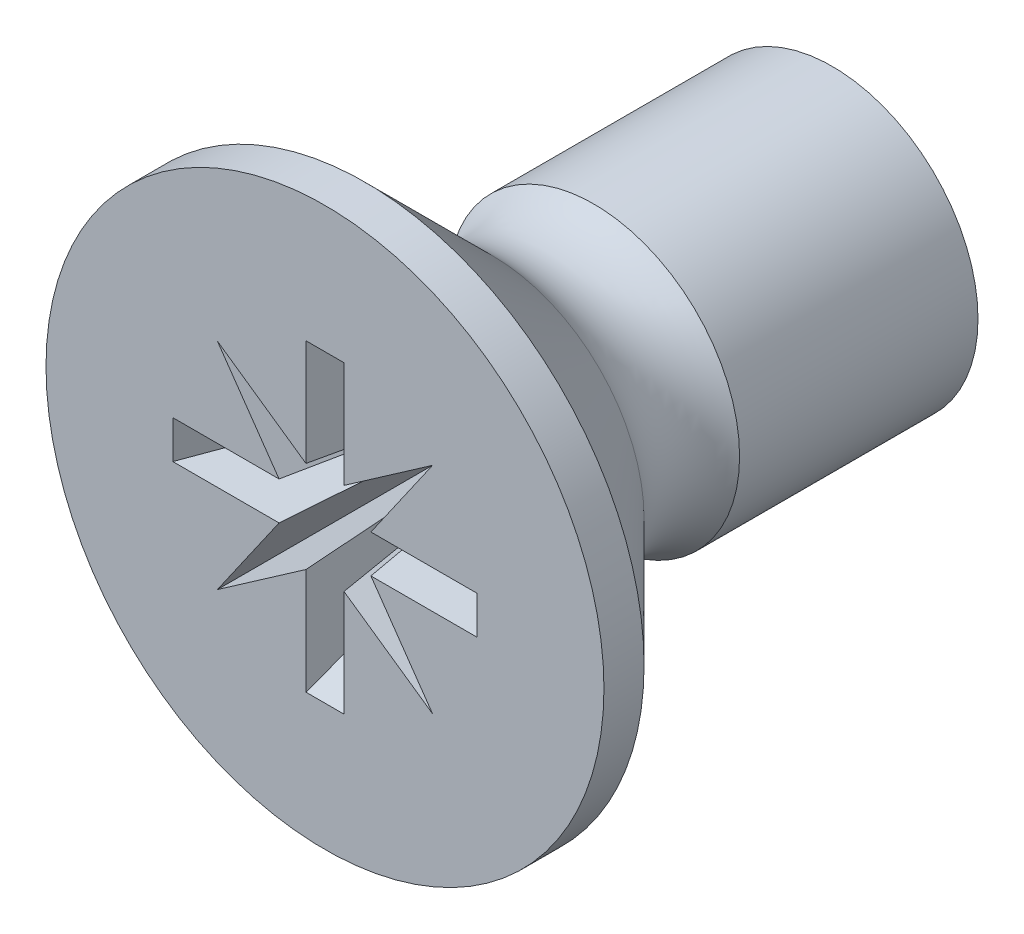
ISO-10303-21;
HEADER;
FILE_DESCRIPTION(('STEP AP214'),'2;1');
FILE_NAME('part.step','',(''),(''),'','','');
FILE_SCHEMA(('AUTOMOTIVE_DESIGN { 1 0 10303 214 1 1 1 1 }'));
ENDSEC;
DATA;
#1=APPLICATION_CONTEXT('core data for automotive mechanical design processes');
#2=APPLICATION_PROTOCOL_DEFINITION('international standard','automotive_design',2000,#1);
#3=PRODUCT_CONTEXT('',#1,'mechanical');
#4=PRODUCT('Part','Part','',(#3));
#5=PRODUCT_RELATED_PRODUCT_CATEGORY('part','',(#4));
#6=PRODUCT_DEFINITION_FORMATION('','',#4);
#7=PRODUCT_DEFINITION_CONTEXT('part definition',#1,'design');
#8=PRODUCT_DEFINITION('design','',#6,#7);
#9=PRODUCT_DEFINITION_SHAPE('','',#8);
#10=(LENGTH_UNIT() NAMED_UNIT(*) SI_UNIT(.MILLI.,.METRE.));
#11=(NAMED_UNIT(*) PLANE_ANGLE_UNIT() SI_UNIT($,.RADIAN.));
#12=(NAMED_UNIT(*) SI_UNIT($,.STERADIAN.) SOLID_ANGLE_UNIT());
#13=UNCERTAINTY_MEASURE_WITH_UNIT(LENGTH_MEASURE(1.E-05),#10,'distance_accuracy_value','');
#14=(GEOMETRIC_REPRESENTATION_CONTEXT(3) GLOBAL_UNCERTAINTY_ASSIGNED_CONTEXT((#13)) GLOBAL_UNIT_ASSIGNED_CONTEXT((#10,
#11,#12)) REPRESENTATION_CONTEXT('',''));
#15=CARTESIAN_POINT('',(0.,0.,0.));
#16=DIRECTION('',(0.,0.,1.));
#17=DIRECTION('',(1.,0.,0.));
#18=AXIS2_PLACEMENT_3D('',#15,#16,#17);
#19=CARTESIAN_POINT('',(0.,0.,-2.18276027382699));
#20=DIRECTION('',(0.,0.,-1.));
#21=DIRECTION('',(-1.,0.,0.));
#22=AXIS2_PLACEMENT_3D('',#19,#20,#21);
#23=TOROIDAL_SURFACE('',#22,2.02806180473974,0.753436804739738);
#24=CARTESIAN_POINT('',(0.,0.,-2.65));
#25=DIRECTION('',(0.,0.,-1.));
#26=DIRECTION('',(-1.,0.,0.));
#27=AXIS2_PLACEMENT_3D('',#24,#25,#26);
#28=CIRCLE('',#27,1.437);
#29=CARTESIAN_POINT('',(-1.437,0.,-2.65));
#30=VERTEX_POINT('',#29);
#31=EDGE_CURVE('E11',#30,#30,#28,.T.);
#32=ORIENTED_EDGE('',*,*,#31,.F.);
#33=EDGE_LOOP('',(#32));
#34=FACE_BOUND('',#33,.T.);
#35=CARTESIAN_POINT('',(0.,0.,-1.65));
#36=DIRECTION('',(0.,0.,-1.));
#37=DIRECTION('',(-1.,0.,0.));
#38=AXIS2_PLACEMENT_3D('',#35,#36,#37);
#39=CIRCLE('',#38,1.49530153091275);
#40=CARTESIAN_POINT('',(-1.49530153091275,0.,-1.65));
#41=VERTEX_POINT('',#40);
#42=EDGE_CURVE('E681',#41,#41,#39,.T.);
#43=ORIENTED_EDGE('',*,*,#42,.T.);
#44=EDGE_LOOP('',(#43));
#45=FACE_BOUND('',#44,.T.);
#46=ADVANCED_FACE('F17',(#34,#45),#23,.F.);
#47=CARTESIAN_POINT('',(0.,0.,0.));
#48=DIRECTION('',(0.,0.,-1.));
#49=DIRECTION('',(-1.,0.,0.));
#50=AXIS2_PLACEMENT_3D('',#47,#48,#49);
#51=CYLINDRICAL_SURFACE('',#50,1.437);
#52=CARTESIAN_POINT('',(0.,0.,-5.));
#53=DIRECTION('',(0.,0.,-1.));
#54=DIRECTION('',(-1.,0.,0.));
#55=AXIS2_PLACEMENT_3D('',#52,#53,#54);
#56=CIRCLE('',#55,1.437);
#57=CARTESIAN_POINT('',(-1.437,0.,-5.));
#58=VERTEX_POINT('',#57);
#59=EDGE_CURVE('E27',#58,#58,#56,.T.);
#60=ORIENTED_EDGE('',*,*,#59,.F.);
#61=EDGE_LOOP('',(#60));
#62=FACE_BOUND('',#61,.T.);
#63=ORIENTED_EDGE('',*,*,#31,.T.);
#64=EDGE_LOOP('',(#63));
#65=FACE_BOUND('',#64,.T.);
#66=ADVANCED_FACE('F671',(#62,#65),#51,.T.);
#67=CARTESIAN_POINT('',(0.,1.437,-5.));
#68=DIRECTION('',(0.,0.,1.));
#69=DIRECTION('',(1.,0.,0.));
#70=AXIS2_PLACEMENT_3D('',#67,#68,#69);
#71=PLANE('',#70);
#72=ORIENTED_EDGE('',*,*,#59,.T.);
#73=EDGE_LOOP('',(#72));
#74=FACE_BOUND('',#73,.T.);
#75=ADVANCED_FACE('F257',(#74),#71,.F.);
#76=CARTESIAN_POINT('',(0.,0.,0.));
#77=DIRECTION('',(0.,0.,-1.));
#78=DIRECTION('',(-1.,0.,0.));
#79=AXIS2_PLACEMENT_3D('',#76,#77,#78);
#80=PLANE('',#79);
#81=DIRECTION('',(0.,-1.,0.));
#82=VECTOR('',#81,1.);
#83=CARTESIAN_POINT('',(0.1875,-0.976332521472478,0.));
#84=LINE('',#83,#82);
#85=CARTESIAN_POINT('',(0.1875,-0.452665042944956,0.));
#86=VERTEX_POINT('',#85);
#87=CARTESIAN_POINT('',(0.1875,-1.5,0.));
#88=VERTEX_POINT('',#87);
#89=EDGE_CURVE('E177',#86,#88,#84,.T.);
#90=ORIENTED_EDGE('',*,*,#89,.T.);
#91=DIRECTION('',(-1.,0.,0.));
#92=VECTOR('',#91,1.);
#93=CARTESIAN_POINT('',(-0.09375,-1.5,0.));
#94=LINE('',#93,#92);
#95=CARTESIAN_POINT('',(-0.1875,-1.5,0.));
#96=VERTEX_POINT('',#95);
#97=EDGE_CURVE('E167',#88,#96,#94,.T.);
#98=ORIENTED_EDGE('',*,*,#97,.T.);
#99=DIRECTION('',(0.,1.,0.));
#100=VECTOR('',#99,1.);
#101=CARTESIAN_POINT('',(-0.1875,-0.976332521472478,0.));
#102=LINE('',#101,#100);
#103=CARTESIAN_POINT('',(-0.1875,-0.452665042944955,0.));
#104=VERTEX_POINT('',#103);
#105=EDGE_CURVE('E41',#96,#104,#102,.T.);
#106=ORIENTED_EDGE('',*,*,#105,.T.);
#107=CARTESIAN_POINT('',(-1.06066017177982,-1.06066017177982,0.));
#108=CARTESIAN_POINT('',(-0.1875,-0.452665042944956,0.));
#109=B_SPLINE_CURVE_WITH_KNOTS('',1,(#107,#108),.UNSPECIFIED.,.F.,.F.,(2,2),(0.,1.),.UNSPECIFIED.);
#110=CARTESIAN_POINT('',(-1.06066017177982,-1.06066017177982,0.));
#111=VERTEX_POINT('',#110);
#112=EDGE_CURVE('E527',#111,#104,#109,.T.);
#113=ORIENTED_EDGE('',*,*,#112,.F.);
#114=CARTESIAN_POINT('',(-0.452665042944956,-0.1875,0.));
#115=CARTESIAN_POINT('',(-1.06066017177982,-1.06066017177982,0.));
#116=B_SPLINE_CURVE_WITH_KNOTS('',1,(#114,#115),.UNSPECIFIED.,.F.,.F.,(2,2),(0.,1.),.UNSPECIFIED.);
#117=CARTESIAN_POINT('',(-0.452665042944956,-0.1875,0.));
#118=VERTEX_POINT('',#117);
#119=EDGE_CURVE('E546',#118,#111,#116,.T.);
#120=ORIENTED_EDGE('',*,*,#119,.F.);
#121=DIRECTION('',(-1.,0.,0.));
#122=VECTOR('',#121,1.);
#123=CARTESIAN_POINT('',(-0.976332521472478,-0.1875,0.));
#124=LINE('',#123,#122);
#125=CARTESIAN_POINT('',(-1.5,-0.1875,0.));
#126=VERTEX_POINT('',#125);
#127=EDGE_CURVE('E549',#118,#126,#124,.T.);
#128=ORIENTED_EDGE('',*,*,#127,.T.);
#129=DIRECTION('',(0.,1.,0.));
#130=VECTOR('',#129,1.);
#131=CARTESIAN_POINT('',(-1.5,-0.09375,0.));
#132=LINE('',#131,#130);
#133=CARTESIAN_POINT('',(-1.5,0.1875,0.));
#134=VERTEX_POINT('',#133);
#135=EDGE_CURVE('E565',#126,#134,#132,.T.);
#136=ORIENTED_EDGE('',*,*,#135,.T.);
#137=DIRECTION('',(1.,0.,0.));
#138=VECTOR('',#137,1.);
#139=CARTESIAN_POINT('',(-0.976332521472478,0.1875,0.));
#140=LINE('',#139,#138);
#141=CARTESIAN_POINT('',(-0.452665042944956,0.1875,0.));
#142=VERTEX_POINT('',#141);
#143=EDGE_CURVE('E588',#134,#142,#140,.T.);
#144=ORIENTED_EDGE('',*,*,#143,.T.);
#145=CARTESIAN_POINT('',(-1.06066017177982,1.06066017177982,0.));
#146=CARTESIAN_POINT('',(-0.452665042944956,0.1875,0.));
#147=B_SPLINE_CURVE_WITH_KNOTS('',1,(#145,#146),.UNSPECIFIED.,.F.,.F.,(2,2),(0.,1.),.UNSPECIFIED.);
#148=CARTESIAN_POINT('',(-1.06066017177982,1.06066017177982,0.));
#149=VERTEX_POINT('',#148);
#150=EDGE_CURVE('E596',#149,#142,#147,.T.);
#151=ORIENTED_EDGE('',*,*,#150,.F.);
#152=CARTESIAN_POINT('',(-0.1875,0.452665042944956,0.));
#153=CARTESIAN_POINT('',(-1.06066017177982,1.06066017177982,0.));
#154=B_SPLINE_CURVE_WITH_KNOTS('',1,(#152,#153),.UNSPECIFIED.,.F.,.F.,(2,2),(0.,1.),.UNSPECIFIED.);
#155=CARTESIAN_POINT('',(-0.1875,0.452665042944956,0.));
#156=VERTEX_POINT('',#155);
#157=EDGE_CURVE('E609',#156,#149,#154,.T.);
#158=ORIENTED_EDGE('',*,*,#157,.F.);
#159=DIRECTION('',(0.,1.,0.));
#160=VECTOR('',#159,1.);
#161=CARTESIAN_POINT('',(-0.1875,0.976332521472478,0.));
#162=LINE('',#161,#160);
#163=CARTESIAN_POINT('',(-0.1875,1.5,0.));
#164=VERTEX_POINT('',#163);
#165=EDGE_CURVE('E612',#156,#164,#162,.T.);
#166=ORIENTED_EDGE('',*,*,#165,.T.);
#167=DIRECTION('',(1.,0.,0.));
#168=VECTOR('',#167,1.);
#169=CARTESIAN_POINT('',(-0.09375,1.5,0.));
#170=LINE('',#169,#168);
#171=CARTESIAN_POINT('',(0.1875,1.5,0.));
#172=VERTEX_POINT('',#171);
#173=EDGE_CURVE('E629',#164,#172,#170,.T.);
#174=ORIENTED_EDGE('',*,*,#173,.T.);
#175=DIRECTION('',(0.,-1.,0.));
#176=VECTOR('',#175,1.);
#177=CARTESIAN_POINT('',(0.1875,0.976332521472478,0.));
#178=LINE('',#177,#176);
#179=CARTESIAN_POINT('',(0.1875,0.452665042944956,0.));
#180=VERTEX_POINT('',#179);
#181=EDGE_CURVE('E326',#172,#180,#178,.T.);
#182=ORIENTED_EDGE('',*,*,#181,.T.);
#183=CARTESIAN_POINT('',(1.06066017177982,1.06066017177982,0.));
#184=CARTESIAN_POINT('',(0.1875,0.452665042944956,0.));
#185=B_SPLINE_CURVE_WITH_KNOTS('',1,(#183,#184),.UNSPECIFIED.,.F.,.F.,(2,2),(0.,1.),.UNSPECIFIED.);
#186=CARTESIAN_POINT('',(1.06066017177982,1.06066017177982,0.));
#187=VERTEX_POINT('',#186);
#188=EDGE_CURVE('E303',#187,#180,#185,.T.);
#189=ORIENTED_EDGE('',*,*,#188,.F.);
#190=CARTESIAN_POINT('',(0.452665042944956,0.1875,0.));
#191=CARTESIAN_POINT('',(1.06066017177982,1.06066017177982,0.));
#192=B_SPLINE_CURVE_WITH_KNOTS('',1,(#190,#191),.UNSPECIFIED.,.F.,.F.,(2,2),(0.,1.),.UNSPECIFIED.);
#193=CARTESIAN_POINT('',(0.452665042944956,0.1875,0.));
#194=VERTEX_POINT('',#193);
#195=EDGE_CURVE('E297',#194,#187,#192,.T.);
#196=ORIENTED_EDGE('',*,*,#195,.F.);
#197=DIRECTION('',(1.,0.,0.));
#198=VECTOR('',#197,1.);
#199=CARTESIAN_POINT('',(0.976332521472478,0.1875,0.));
#200=LINE('',#199,#198);
#201=CARTESIAN_POINT('',(1.5,0.1875,0.));
#202=VERTEX_POINT('',#201);
#203=EDGE_CURVE('E300',#194,#202,#200,.T.);
#204=ORIENTED_EDGE('',*,*,#203,.T.);
#205=DIRECTION('',(0.,-1.,0.));
#206=VECTOR('',#205,1.);
#207=CARTESIAN_POINT('',(1.5,0.09375,0.));
#208=LINE('',#207,#206);
#209=CARTESIAN_POINT('',(1.5,-0.1875,0.));
#210=VERTEX_POINT('',#209);
#211=EDGE_CURVE('E497',#202,#210,#208,.T.);
#212=ORIENTED_EDGE('',*,*,#211,.T.);
#213=DIRECTION('',(-1.,0.,0.));
#214=VECTOR('',#213,1.);
#215=CARTESIAN_POINT('',(0.976332521472478,-0.1875,0.));
#216=LINE('',#215,#214);
#217=CARTESIAN_POINT('',(0.452665042944956,-0.1875,0.));
#218=VERTEX_POINT('',#217);
#219=EDGE_CURVE('E468',#210,#218,#216,.T.);
#220=ORIENTED_EDGE('',*,*,#219,.T.);
#221=CARTESIAN_POINT('',(1.06066017177982,-1.06066017177982,0.));
#222=CARTESIAN_POINT('',(0.452665042944956,-0.1875,0.));
#223=B_SPLINE_CURVE_WITH_KNOTS('',1,(#221,#222),.UNSPECIFIED.,.F.,.F.,(2,2),(0.,1.),.UNSPECIFIED.);
#224=CARTESIAN_POINT('',(1.06066017177982,-1.06066017177982,0.));
#225=VERTEX_POINT('',#224);
#226=EDGE_CURVE('E236',#225,#218,#223,.T.);
#227=ORIENTED_EDGE('',*,*,#226,.F.);
#228=CARTESIAN_POINT('',(0.1875,-0.452665042944956,0.));
#229=CARTESIAN_POINT('',(1.06066017177982,-1.06066017177982,0.));
#230=B_SPLINE_CURVE_WITH_KNOTS('',1,(#228,#229),.UNSPECIFIED.,.F.,.F.,(2,2),(0.,1.),.UNSPECIFIED.);
#231=EDGE_CURVE('E194',#86,#225,#230,.T.);
#232=ORIENTED_EDGE('',*,*,#231,.F.);
#233=EDGE_LOOP('',(#90,#98,#106,#113,#120,#128,#136,#144,#151,#158,#166,#174,#182,#189,#196,
#204,#212,#220,#227,#232));
#234=FACE_BOUND('',#233,.T.);
#235=CARTESIAN_POINT('',(0.,0.,0.));
#236=DIRECTION('',(0.,0.,-1.));
#237=DIRECTION('',(-1.,0.,0.));
#238=AXIS2_PLACEMENT_3D('',#235,#236,#237);
#239=CIRCLE('',#238,2.75);
#240=CARTESIAN_POINT('',(-2.75,0.,0.));
#241=VERTEX_POINT('',#240);
#242=EDGE_CURVE('E686',#241,#241,#239,.T.);
#243=ORIENTED_EDGE('',*,*,#242,.F.);
#244=EDGE_LOOP('',(#243));
#245=FACE_BOUND('',#244,.T.);
#246=ADVANCED_FACE('F238',(#234,#245),#80,.F.);
#247=CARTESIAN_POINT('',(0.,0.,0.));
#248=DIRECTION('',(0.,0.,-1.));
#249=DIRECTION('',(-1.,0.,0.));
#250=AXIS2_PLACEMENT_3D('',#247,#248,#249);
#251=CYLINDRICAL_SURFACE('',#250,2.75);
#252=CARTESIAN_POINT('',(0.,0.,-0.39530153091274));
#253=DIRECTION('',(0.,0.,-1.));
#254=DIRECTION('',(-1.,0.,0.));
#255=AXIS2_PLACEMENT_3D('',#252,#253,#254);
#256=CIRCLE('',#255,2.75);
#257=CARTESIAN_POINT('',(-2.75,0.,-0.39530153091274));
#258=VERTEX_POINT('',#257);
#259=EDGE_CURVE('E683',#258,#258,#256,.T.);
#260=ORIENTED_EDGE('',*,*,#259,.F.);
#261=EDGE_LOOP('',(#260));
#262=FACE_BOUND('',#261,.T.);
#263=ORIENTED_EDGE('',*,*,#242,.T.);
#264=EDGE_LOOP('',(#263));
#265=FACE_BOUND('',#264,.T.);
#266=ADVANCED_FACE('F256',(#262,#265),#251,.T.);
#267=CARTESIAN_POINT('',(0.,0.,-0.39530153091274));
#268=DIRECTION('',(0.,0.,1.));
#269=DIRECTION('',(1.,0.,0.));
#270=AXIS2_PLACEMENT_3D('',#267,#268,#269);
#271=CONICAL_SURFACE('',#270,2.75,0.785398163397446);
#272=ORIENTED_EDGE('',*,*,#42,.F.);
#273=EDGE_LOOP('',(#272));
#274=FACE_BOUND('',#273,.T.);
#275=ORIENTED_EDGE('',*,*,#259,.T.);
#276=EDGE_LOOP('',(#275));
#277=FACE_BOUND('',#276,.T.);
#278=ADVANCED_FACE('F832',(#274,#277),#271,.T.);
#279=CARTESIAN_POINT('',(0.13125,-1.05,-1.005));
#280=DIRECTION('',(-0.998437341694377,0.,0.0558826870351329));
#281=DIRECTION('',(0.0558826870351329,0.,0.998437341694377));
#282=AXIS2_PLACEMENT_3D('',#279,#280,#281);
#283=PLANE('',#282);
#284=CARTESIAN_POINT('',(0.075,-0.181066017177982,-2.01));
#285=CARTESIAN_POINT('',(0.1875,-0.452665042944956,0.));
#286=B_SPLINE_CURVE_WITH_KNOTS('',1,(#284,#285),.UNSPECIFIED.,.F.,.F.,(2,2),(0.,1.),.UNSPECIFIED.);
#287=CARTESIAN_POINT('',(0.075,-0.181066017177982,-2.01));
#288=VERTEX_POINT('',#287);
#289=EDGE_CURVE('E180',#288,#86,#286,.T.);
#290=ORIENTED_EDGE('',*,*,#289,.F.);
#291=DIRECTION('',(0.,-1.,0.));
#292=VECTOR('',#291,1.);
#293=CARTESIAN_POINT('',(0.075,-0.390533008588991,-2.01));
#294=LINE('',#293,#292);
#295=CARTESIAN_POINT('',(0.075,-0.6,-2.01));
#296=VERTEX_POINT('',#295);
#297=EDGE_CURVE('E163',#288,#296,#294,.T.);
#298=ORIENTED_EDGE('',*,*,#297,.T.);
#299=DIRECTION('',(0.0510165718537471,-0.408132574829977,0.911496083786949));
#300=VECTOR('',#299,1.);
#301=CARTESIAN_POINT('',(0.13125,-1.05,-1.005));
#302=LINE('',#301,#300);
#303=EDGE_CURVE('E171',#296,#88,#302,.T.);
#304=ORIENTED_EDGE('',*,*,#303,.T.);
#305=ORIENTED_EDGE('',*,*,#89,.F.);
#306=EDGE_LOOP('',(#290,#298,#304,#305));
#307=FACE_BOUND('',#306,.T.);
#308=ADVANCED_FACE('F179',(#307),#283,.T.);
#309=CARTESIAN_POINT('',(0.419478270999549,-0.41947827099955,-2.01));
#310=CARTESIAN_POINT('',(1.06066017177982,-1.06066017177982,0.));
#311=CARTESIAN_POINT('',(0.075,-0.181066017177982,-2.01));
#312=CARTESIAN_POINT('',(0.1875,-0.452665042944956,0.));
#313=B_SPLINE_SURFACE_WITH_KNOTS('',1,1,((#309,#310),(#311,#312)),.UNSPECIFIED.,.F.,.F.,.F.,(2,
2),(2,2),(0.,1.),(0.,1.),.UNSPECIFIED.);
#314=CARTESIAN_POINT('',(0.419478270999549,-0.41947827099955,-2.01));
#315=CARTESIAN_POINT('',(0.075,-0.181066017177982,-2.01));
#316=B_SPLINE_CURVE_WITH_KNOTS('',1,(#314,#315),.UNSPECIFIED.,.F.,.F.,(2,2),(0.,1.),.UNSPECIFIED.);
#317=CARTESIAN_POINT('',(0.419478270999549,-0.41947827099955,-2.01));
#318=VERTEX_POINT('',#317);
#319=EDGE_CURVE('E235',#318,#288,#316,.T.);
#320=CARTESIAN_POINT('',(0.419478270999549,-0.41947827099955,-2.01));
#321=CARTESIAN_POINT('',(1.06066017177982,-1.06066017177982,0.));
#322=B_SPLINE_CURVE_WITH_KNOTS('',1,(#320,#321),.UNSPECIFIED.,.F.,.F.,(2,2),(0.,1.),.UNSPECIFIED.);
#323=EDGE_CURVE('E476',#318,#225,#322,.T.);
#324=ORIENTED_EDGE('',*,*,#319,.T.);
#325=ORIENTED_EDGE('',*,*,#289,.T.);
#326=ORIENTED_EDGE('',*,*,#231,.T.);
#327=ORIENTED_EDGE('',*,*,#323,.F.);
#328=EDGE_LOOP('',(#324,#325,#326,#327));
#329=FACE_BOUND('',#328,.T.);
#330=ADVANCED_FACE('F201',(#329),#313,.T.);
#331=CARTESIAN_POINT('',(0.181066017177982,-0.075,-2.01));
#332=CARTESIAN_POINT('',(0.452665042944956,-0.1875,0.));
#333=CARTESIAN_POINT('',(0.419478270999549,-0.41947827099955,-2.01));
#334=CARTESIAN_POINT('',(1.06066017177982,-1.06066017177982,0.));
#335=B_SPLINE_SURFACE_WITH_KNOTS('',1,1,((#331,#332),(#333,#334)),.UNSPECIFIED.,.F.,.F.,.F.,(2,
2),(2,2),(0.,1.),(0.,1.),.UNSPECIFIED.);
#336=CARTESIAN_POINT('',(0.181066017177982,-0.075,-2.01));
#337=CARTESIAN_POINT('',(0.419478270999549,-0.41947827099955,-2.01));
#338=B_SPLINE_CURVE_WITH_KNOTS('',1,(#336,#337),.UNSPECIFIED.,.F.,.F.,(2,2),(0.,1.),.UNSPECIFIED.);
#339=CARTESIAN_POINT('',(0.181066017177982,-0.075,-2.01));
#340=VERTEX_POINT('',#339);
#341=EDGE_CURVE('E457',#340,#318,#338,.T.);
#342=DIRECTION('',(0.133701447954385,-0.055380953051627,0.989473027855734));
#343=VECTOR('',#342,1.);
#344=CARTESIAN_POINT('',(0.316865530061469,-0.13125,-1.005));
#345=LINE('',#344,#343);
#346=EDGE_CURVE('E461',#340,#218,#345,.T.);
#347=ORIENTED_EDGE('',*,*,#341,.T.);
#348=ORIENTED_EDGE('',*,*,#323,.T.);
#349=ORIENTED_EDGE('',*,*,#226,.T.);
#350=ORIENTED_EDGE('',*,*,#346,.F.);
#351=EDGE_LOOP('',(#347,#348,#349,#350));
#352=FACE_BOUND('',#351,.T.);
#353=ADVANCED_FACE('F213',(#352),#335,.T.);
#354=CARTESIAN_POINT('',(1.05,-0.13125,-1.005));
#355=DIRECTION('',(0.,0.998437341694377,0.0558826870351332));
#356=DIRECTION('',(0.,-0.0558826870351332,0.998437341694377));
#357=AXIS2_PLACEMENT_3D('',#354,#355,#356);
#358=PLANE('',#357);
#359=DIRECTION('',(0.408132574829978,-0.0510165718537472,0.911496083786949));
#360=VECTOR('',#359,1.);
#361=CARTESIAN_POINT('',(1.05,-0.13125,-1.005));
#362=LINE('',#361,#360);
#363=CARTESIAN_POINT('',(0.6,-0.075,-2.01));
#364=VERTEX_POINT('',#363);
#365=EDGE_CURVE('E500',#364,#210,#362,.T.);
#366=ORIENTED_EDGE('',*,*,#365,.F.);
#367=DIRECTION('',(-1.,0.,0.));
#368=VECTOR('',#367,1.);
#369=CARTESIAN_POINT('',(0.390533008588991,-0.075,-2.01));
#370=LINE('',#369,#368);
#371=EDGE_CURVE('E469',#364,#340,#370,.T.);
#372=ORIENTED_EDGE('',*,*,#371,.T.);
#373=ORIENTED_EDGE('',*,*,#346,.T.);
#374=ORIENTED_EDGE('',*,*,#219,.F.);
#375=EDGE_LOOP('',(#366,#372,#373,#374));
#376=FACE_BOUND('',#375,.T.);
#377=ADVANCED_FACE('F803',(#376),#358,.T.);
#378=CARTESIAN_POINT('',(1.05,0.13125,-1.005));
#379=DIRECTION('',(-0.912684575394031,0.,0.408664735251059));
#380=DIRECTION('',(0.408664735251059,0.,0.912684575394031));
#381=AXIS2_PLACEMENT_3D('',#378,#379,#380);
#382=PLANE('',#381);
#383=DIRECTION('',(0.408132574829978,0.0510165718537472,0.911496083786949));
#384=VECTOR('',#383,1.);
#385=CARTESIAN_POINT('',(1.05,0.13125,-1.005));
#386=LINE('',#385,#384);
#387=CARTESIAN_POINT('',(0.6,0.075,-2.01));
#388=VERTEX_POINT('',#387);
#389=EDGE_CURVE('E309',#388,#202,#386,.T.);
#390=ORIENTED_EDGE('',*,*,#389,.F.);
#391=DIRECTION('',(0.,-1.,0.));
#392=VECTOR('',#391,1.);
#393=CARTESIAN_POINT('',(0.6,0.0375,-2.01));
#394=LINE('',#393,#392);
#395=EDGE_CURVE('E502',#388,#364,#394,.T.);
#396=ORIENTED_EDGE('',*,*,#395,.T.);
#397=ORIENTED_EDGE('',*,*,#365,.T.);
#398=ORIENTED_EDGE('',*,*,#211,.F.);
#399=EDGE_LOOP('',(#390,#396,#397,#398));
#400=FACE_BOUND('',#399,.T.);
#401=ADVANCED_FACE('F669',(#400),#382,.T.);
#402=CARTESIAN_POINT('',(1.05,0.13125,-1.005));
#403=DIRECTION('',(0.,-0.998437341694377,0.0558826870351331));
#404=DIRECTION('',(0.,-0.0558826870351331,-0.998437341694377));
#405=AXIS2_PLACEMENT_3D('',#402,#403,#404);
#406=PLANE('',#405);
#407=CARTESIAN_POINT('',(0.181066017177982,0.075,-2.01));
#408=CARTESIAN_POINT('',(0.452665042944956,0.1875,0.));
#409=B_SPLINE_CURVE_WITH_KNOTS('',1,(#407,#408),.UNSPECIFIED.,.F.,.F.,(2,2),(0.,1.),.UNSPECIFIED.);
#410=CARTESIAN_POINT('',(0.181066017177982,0.075,-2.01));
#411=VERTEX_POINT('',#410);
#412=EDGE_CURVE('E306',#411,#194,#409,.T.);
#413=ORIENTED_EDGE('',*,*,#412,.F.);
#414=DIRECTION('',(1.,0.,0.));
#415=VECTOR('',#414,1.);
#416=CARTESIAN_POINT('',(0.390533008588991,0.075,-2.01));
#417=LINE('',#416,#415);
#418=EDGE_CURVE('E311',#411,#388,#417,.T.);
#419=ORIENTED_EDGE('',*,*,#418,.T.);
#420=ORIENTED_EDGE('',*,*,#389,.T.);
#421=ORIENTED_EDGE('',*,*,#203,.F.);
#422=EDGE_LOOP('',(#413,#419,#420,#421));
#423=FACE_BOUND('',#422,.T.);
#424=ADVANCED_FACE('F662',(#423),#406,.T.);
#425=CARTESIAN_POINT('',(0.419478270999549,0.41947827099955,-2.01));
#426=CARTESIAN_POINT('',(1.06066017177982,1.06066017177982,0.));
#427=CARTESIAN_POINT('',(0.181066017177982,0.075,-2.01));
#428=CARTESIAN_POINT('',(0.452665042944956,0.1875,0.));
#429=B_SPLINE_SURFACE_WITH_KNOTS('',1,1,((#425,#426),(#427,#428)),.UNSPECIFIED.,.F.,.F.,.F.,(2,
2),(2,2),(0.,1.),(0.,1.),.UNSPECIFIED.);
#430=CARTESIAN_POINT('',(0.419478270999549,0.41947827099955,-2.01));
#431=CARTESIAN_POINT('',(0.181066017177982,0.075,-2.01));
#432=B_SPLINE_CURVE_WITH_KNOTS('',1,(#430,#431),.UNSPECIFIED.,.F.,.F.,(2,2),(0.,1.),.UNSPECIFIED.);
#433=CARTESIAN_POINT('',(0.419478270999549,0.41947827099955,-2.01));
#434=VERTEX_POINT('',#433);
#435=EDGE_CURVE('E307',#434,#411,#432,.T.);
#436=CARTESIAN_POINT('',(0.419478270999549,0.41947827099955,-2.01));
#437=CARTESIAN_POINT('',(1.06066017177982,1.06066017177982,0.));
#438=B_SPLINE_CURVE_WITH_KNOTS('',1,(#436,#437),.UNSPECIFIED.,.F.,.F.,(2,2),(0.,1.),.UNSPECIFIED.);
#439=EDGE_CURVE('E374',#434,#187,#438,.T.);
#440=ORIENTED_EDGE('',*,*,#435,.T.);
#441=ORIENTED_EDGE('',*,*,#412,.T.);
#442=ORIENTED_EDGE('',*,*,#195,.T.);
#443=ORIENTED_EDGE('',*,*,#439,.F.);
#444=EDGE_LOOP('',(#440,#441,#442,#443));
#445=FACE_BOUND('',#444,.T.);
#446=ADVANCED_FACE('F340',(#445),#429,.T.);
#447=CARTESIAN_POINT('',(0.075,0.181066017177982,-2.01));
#448=CARTESIAN_POINT('',(0.1875,0.452665042944956,0.));
#449=CARTESIAN_POINT('',(0.419478270999549,0.41947827099955,-2.01));
#450=CARTESIAN_POINT('',(1.06066017177982,1.06066017177982,0.));
#451=B_SPLINE_SURFACE_WITH_KNOTS('',1,1,((#447,#448),(#449,#450)),.UNSPECIFIED.,.F.,.F.,.F.,(2,
2),(2,2),(0.,1.),(0.,1.),.UNSPECIFIED.);
#452=CARTESIAN_POINT('',(0.075,0.181066017177982,-2.01));
#453=CARTESIAN_POINT('',(0.419478270999549,0.41947827099955,-2.01));
#454=B_SPLINE_CURVE_WITH_KNOTS('',1,(#452,#453),.UNSPECIFIED.,.F.,.F.,(2,2),(0.,1.),.UNSPECIFIED.);
#455=CARTESIAN_POINT('',(0.075,0.181066017177982,-2.01));
#456=VERTEX_POINT('',#455);
#457=EDGE_CURVE('E371',#456,#434,#454,.T.);
#458=DIRECTION('',(0.0553809530516269,0.133701447954385,0.989473027855734));
#459=VECTOR('',#458,1.);
#460=CARTESIAN_POINT('',(0.13125,0.316865530061469,-1.005));
#461=LINE('',#460,#459);
#462=EDGE_CURVE('E359',#456,#180,#461,.T.);
#463=ORIENTED_EDGE('',*,*,#457,.T.);
#464=ORIENTED_EDGE('',*,*,#439,.T.);
#465=ORIENTED_EDGE('',*,*,#188,.T.);
#466=ORIENTED_EDGE('',*,*,#462,.F.);
#467=EDGE_LOOP('',(#463,#464,#465,#466));
#468=FACE_BOUND('',#467,.T.);
#469=ADVANCED_FACE('F328',(#468),#451,.T.);
#470=CARTESIAN_POINT('',(0.13125,1.05,-1.005));
#471=DIRECTION('',(-0.998437341694377,0.,0.0558826870351331));
#472=DIRECTION('',(0.0558826870351331,0.,0.998437341694377));
#473=AXIS2_PLACEMENT_3D('',#470,#471,#472);
#474=PLANE('',#473);
#475=DIRECTION('',(0.0510165718537471,0.408132574829977,0.911496083786949));
#476=VECTOR('',#475,1.);
#477=CARTESIAN_POINT('',(0.13125,1.05,-1.005));
#478=LINE('',#477,#476);
#479=CARTESIAN_POINT('',(0.075,0.6,-2.01));
#480=VERTEX_POINT('',#479);
#481=EDGE_CURVE('E636',#480,#172,#478,.T.);
#482=ORIENTED_EDGE('',*,*,#481,.F.);
#483=DIRECTION('',(0.,-1.,0.));
#484=VECTOR('',#483,1.);
#485=CARTESIAN_POINT('',(0.075,0.390533008588991,-2.01));
#486=LINE('',#485,#484);
#487=EDGE_CURVE('E366',#480,#456,#486,.T.);
#488=ORIENTED_EDGE('',*,*,#487,.T.);
#489=ORIENTED_EDGE('',*,*,#462,.T.);
#490=ORIENTED_EDGE('',*,*,#181,.F.);
#491=EDGE_LOOP('',(#482,#488,#489,#490));
#492=FACE_BOUND('',#491,.T.);
#493=ADVANCED_FACE('F339',(#492),#474,.T.);
#494=CARTESIAN_POINT('',(-0.13125,1.05,-1.005));
#495=DIRECTION('',(0.,-0.912684575394031,0.408664735251059));
#496=DIRECTION('',(0.,-0.408664735251059,-0.912684575394031));
#497=AXIS2_PLACEMENT_3D('',#494,#495,#496);
#498=PLANE('',#497);
#499=DIRECTION('',(-0.0510165718537471,0.408132574829977,0.911496083786949));
#500=VECTOR('',#499,1.);
#501=CARTESIAN_POINT('',(-0.13125,1.05,-1.005));
#502=LINE('',#501,#500);
#503=CARTESIAN_POINT('',(-0.075,0.6,-2.01));
#504=VERTEX_POINT('',#503);
#505=EDGE_CURVE('E628',#504,#164,#502,.T.);
#506=ORIENTED_EDGE('',*,*,#505,.F.);
#507=DIRECTION('',(1.,0.,0.));
#508=VECTOR('',#507,1.);
#509=CARTESIAN_POINT('',(-0.0375,0.6,-2.01));
#510=LINE('',#509,#508);
#511=EDGE_CURVE('E640',#504,#480,#510,.T.);
#512=ORIENTED_EDGE('',*,*,#511,.T.);
#513=ORIENTED_EDGE('',*,*,#481,.T.);
#514=ORIENTED_EDGE('',*,*,#173,.F.);
#515=EDGE_LOOP('',(#506,#512,#513,#514));
#516=FACE_BOUND('',#515,.T.);
#517=ADVANCED_FACE('F732',(#516),#498,.T.);
#518=CARTESIAN_POINT('',(-0.13125,1.05,-1.005));
#519=DIRECTION('',(0.998437341694377,0.,0.0558826870351332));
#520=DIRECTION('',(0.0558826870351332,0.,-0.998437341694377));
#521=AXIS2_PLACEMENT_3D('',#518,#519,#520);
#522=PLANE('',#521);
#523=CARTESIAN_POINT('',(-0.075,0.181066017177982,-2.01));
#524=CARTESIAN_POINT('',(-0.1875,0.452665042944956,0.));
#525=B_SPLINE_CURVE_WITH_KNOTS('',1,(#523,#524),.UNSPECIFIED.,.F.,.F.,(2,2),(0.,1.),.UNSPECIFIED.);
#526=CARTESIAN_POINT('',(-0.075,0.181066017177982,-2.01));
#527=VERTEX_POINT('',#526);
#528=EDGE_CURVE('E607',#527,#156,#525,.T.);
#529=ORIENTED_EDGE('',*,*,#528,.F.);
#530=DIRECTION('',(0.,1.,0.));
#531=VECTOR('',#530,1.);
#532=CARTESIAN_POINT('',(-0.075,0.390533008588991,-2.01));
#533=LINE('',#532,#531);
#534=EDGE_CURVE('E622',#527,#504,#533,.T.);
#535=ORIENTED_EDGE('',*,*,#534,.T.);
#536=ORIENTED_EDGE('',*,*,#505,.T.);
#537=ORIENTED_EDGE('',*,*,#165,.F.);
#538=EDGE_LOOP('',(#529,#535,#536,#537));
#539=FACE_BOUND('',#538,.T.);
#540=ADVANCED_FACE('F734',(#539),#522,.T.);
#541=CARTESIAN_POINT('',(-0.419478270999549,0.41947827099955,-2.01));
#542=CARTESIAN_POINT('',(-1.06066017177982,1.06066017177982,0.));
#543=CARTESIAN_POINT('',(-0.075,0.181066017177982,-2.01));
#544=CARTESIAN_POINT('',(-0.1875,0.452665042944956,0.));
#545=B_SPLINE_SURFACE_WITH_KNOTS('',1,1,((#541,#542),(#543,#544)),.UNSPECIFIED.,.F.,.F.,.F.,(2,
2),(2,2),(0.,1.),(0.,1.),.UNSPECIFIED.);
#546=CARTESIAN_POINT('',(-0.419478270999549,0.41947827099955,-2.01));
#547=CARTESIAN_POINT('',(-0.075,0.181066017177982,-2.01));
#548=B_SPLINE_CURVE_WITH_KNOTS('',1,(#546,#547),.UNSPECIFIED.,.F.,.F.,(2,2),(0.,1.),.UNSPECIFIED.);
#549=CARTESIAN_POINT('',(-0.419478270999549,0.41947827099955,-2.01));
#550=VERTEX_POINT('',#549);
#551=EDGE_CURVE('E577',#550,#527,#548,.T.);
#552=CARTESIAN_POINT('',(-0.419478270999549,0.41947827099955,-2.01));
#553=CARTESIAN_POINT('',(-1.06066017177982,1.06066017177982,0.));
#554=B_SPLINE_CURVE_WITH_KNOTS('',1,(#552,#553),.UNSPECIFIED.,.F.,.F.,(2,2),(0.,1.),.UNSPECIFIED.);
#555=EDGE_CURVE('E579',#550,#149,#554,.T.);
#556=ORIENTED_EDGE('',*,*,#551,.T.);
#557=ORIENTED_EDGE('',*,*,#528,.T.);
#558=ORIENTED_EDGE('',*,*,#157,.T.);
#559=ORIENTED_EDGE('',*,*,#555,.F.);
#560=EDGE_LOOP('',(#556,#557,#558,#559));
#561=FACE_BOUND('',#560,.T.);
#562=ADVANCED_FACE('F737',(#561),#545,.T.);
#563=CARTESIAN_POINT('',(-0.181066017177982,0.075,-2.01));
#564=CARTESIAN_POINT('',(-0.452665042944956,0.1875,0.));
#565=CARTESIAN_POINT('',(-0.419478270999549,0.41947827099955,-2.01));
#566=CARTESIAN_POINT('',(-1.06066017177982,1.06066017177982,0.));
#567=B_SPLINE_SURFACE_WITH_KNOTS('',1,1,((#563,#564),(#565,#566)),.UNSPECIFIED.,.F.,.F.,.F.,(2,
2),(2,2),(0.,1.),(0.,1.),.UNSPECIFIED.);
#568=CARTESIAN_POINT('',(-0.181066017177982,0.075,-2.01));
#569=CARTESIAN_POINT('',(-0.419478270999549,0.41947827099955,-2.01));
#570=B_SPLINE_CURVE_WITH_KNOTS('',1,(#568,#569),.UNSPECIFIED.,.F.,.F.,(2,2),(0.,1.),.UNSPECIFIED.);
#571=CARTESIAN_POINT('',(-0.181066017177982,0.075,-2.01));
#572=VERTEX_POINT('',#571);
#573=EDGE_CURVE('E571',#572,#550,#570,.T.);
#574=DIRECTION('',(-0.133701447954386,0.055380953051627,0.989473027855734));
#575=VECTOR('',#574,1.);
#576=CARTESIAN_POINT('',(-0.316865530061469,0.13125,-1.005));
#577=LINE('',#576,#575);
#578=EDGE_CURVE('E584',#572,#142,#577,.T.);
#579=ORIENTED_EDGE('',*,*,#573,.T.);
#580=ORIENTED_EDGE('',*,*,#555,.T.);
#581=ORIENTED_EDGE('',*,*,#150,.T.);
#582=ORIENTED_EDGE('',*,*,#578,.F.);
#583=EDGE_LOOP('',(#579,#580,#581,#582));
#584=FACE_BOUND('',#583,.T.);
#585=ADVANCED_FACE('F754',(#584),#567,.T.);
#586=CARTESIAN_POINT('',(-1.05,0.13125,-1.005));
#587=DIRECTION('',(0.,-0.998437341694377,0.0558826870351332));
#588=DIRECTION('',(0.,-0.0558826870351332,-0.998437341694377));
#589=AXIS2_PLACEMENT_3D('',#586,#587,#588);
#590=PLANE('',#589);
#591=DIRECTION('',(-0.408132574829978,0.0510165718537472,0.911496083786949));
#592=VECTOR('',#591,1.);
#593=CARTESIAN_POINT('',(-1.05,0.13125,-1.005));
#594=LINE('',#593,#592);
#595=CARTESIAN_POINT('',(-0.6,0.075,-2.01));
#596=VERTEX_POINT('',#595);
#597=EDGE_CURVE('E586',#596,#134,#594,.T.);
#598=ORIENTED_EDGE('',*,*,#597,.F.);
#599=DIRECTION('',(1.,0.,0.));
#600=VECTOR('',#599,1.);
#601=CARTESIAN_POINT('',(-0.390533008588991,0.075,-2.01));
#602=LINE('',#601,#600);
#603=EDGE_CURVE('E574',#596,#572,#602,.T.);
#604=ORIENTED_EDGE('',*,*,#603,.T.);
#605=ORIENTED_EDGE('',*,*,#578,.T.);
#606=ORIENTED_EDGE('',*,*,#143,.F.);
#607=EDGE_LOOP('',(#598,#604,#605,#606));
#608=FACE_BOUND('',#607,.T.);
#609=ADVANCED_FACE('F582',(#608),#590,.T.);
#610=CARTESIAN_POINT('',(-1.05,-0.13125,-1.005));
#611=DIRECTION('',(0.912684575394031,0.,0.408664735251059));
#612=DIRECTION('',(0.408664735251059,0.,-0.912684575394031));
#613=AXIS2_PLACEMENT_3D('',#610,#611,#612);
#614=PLANE('',#613);
#615=DIRECTION('',(-0.408132574829978,-0.0510165718537472,0.911496083786949));
#616=VECTOR('',#615,1.);
#617=CARTESIAN_POINT('',(-1.05,-0.13125,-1.005));
#618=LINE('',#617,#616);
#619=CARTESIAN_POINT('',(-0.6,-0.075,-2.01));
#620=VERTEX_POINT('',#619);
#621=EDGE_CURVE('E564',#620,#126,#618,.T.);
#622=ORIENTED_EDGE('',*,*,#621,.F.);
#623=DIRECTION('',(0.,1.,0.));
#624=VECTOR('',#623,1.);
#625=CARTESIAN_POINT('',(-0.6,-0.0375,-2.01));
#626=LINE('',#625,#624);
#627=EDGE_CURVE('E727',#620,#596,#626,.T.);
#628=ORIENTED_EDGE('',*,*,#627,.T.);
#629=ORIENTED_EDGE('',*,*,#597,.T.);
#630=ORIENTED_EDGE('',*,*,#135,.F.);
#631=EDGE_LOOP('',(#622,#628,#629,#630));
#632=FACE_BOUND('',#631,.T.);
#633=ADVANCED_FACE('F911',(#632),#614,.T.);
#634=CARTESIAN_POINT('',(-1.05,-0.13125,-1.005));
#635=DIRECTION('',(0.,0.998437341694377,0.0558826870351331));
#636=DIRECTION('',(0.,-0.0558826870351332,0.998437341694377));
#637=AXIS2_PLACEMENT_3D('',#634,#635,#636);
#638=PLANE('',#637);
#639=CARTESIAN_POINT('',(-0.181066017177982,-0.075,-2.01));
#640=CARTESIAN_POINT('',(-0.452665042944956,-0.1875,0.));
#641=B_SPLINE_CURVE_WITH_KNOTS('',1,(#639,#640),.UNSPECIFIED.,.F.,.F.,(2,2),(0.,1.),.UNSPECIFIED.);
#642=CARTESIAN_POINT('',(-0.181066017177982,-0.075,-2.01));
#643=VERTEX_POINT('',#642);
#644=EDGE_CURVE('E544',#643,#118,#641,.T.);
#645=ORIENTED_EDGE('',*,*,#644,.F.);
#646=DIRECTION('',(-1.,0.,0.));
#647=VECTOR('',#646,1.);
#648=CARTESIAN_POINT('',(-0.390533008588991,-0.075,-2.01));
#649=LINE('',#648,#647);
#650=EDGE_CURVE('E558',#643,#620,#649,.T.);
#651=ORIENTED_EDGE('',*,*,#650,.T.);
#652=ORIENTED_EDGE('',*,*,#621,.T.);
#653=ORIENTED_EDGE('',*,*,#127,.F.);
#654=EDGE_LOOP('',(#645,#651,#652,#653));
#655=FACE_BOUND('',#654,.T.);
#656=ADVANCED_FACE('F918',(#655),#638,.T.);
#657=CARTESIAN_POINT('',(-0.419478270999549,-0.41947827099955,-2.01));
#658=CARTESIAN_POINT('',(-1.06066017177982,-1.06066017177982,0.));
#659=CARTESIAN_POINT('',(-0.181066017177982,-0.075,-2.01));
#660=CARTESIAN_POINT('',(-0.452665042944956,-0.1875,0.));
#661=B_SPLINE_SURFACE_WITH_KNOTS('',1,1,((#657,#658),(#659,#660)),.UNSPECIFIED.,.F.,.F.,.F.,(2,
2),(2,2),(0.,1.),(0.,1.),.UNSPECIFIED.);
#662=CARTESIAN_POINT('',(-0.419478270999549,-0.41947827099955,-2.01));
#663=CARTESIAN_POINT('',(-0.181066017177982,-0.075,-2.01));
#664=B_SPLINE_CURVE_WITH_KNOTS('',1,(#662,#663),.UNSPECIFIED.,.F.,.F.,(2,2),(0.,1.),.UNSPECIFIED.);
#665=CARTESIAN_POINT('',(-0.419478270999549,-0.41947827099955,-2.01));
#666=VERTEX_POINT('',#665);
#667=EDGE_CURVE('E519',#666,#643,#664,.T.);
#668=CARTESIAN_POINT('',(-0.419478270999549,-0.41947827099955,-2.01));
#669=CARTESIAN_POINT('',(-1.06066017177982,-1.06066017177982,0.));
#670=B_SPLINE_CURVE_WITH_KNOTS('',1,(#668,#669),.UNSPECIFIED.,.F.,.F.,(2,2),(0.,1.),.UNSPECIFIED.);
#671=EDGE_CURVE('E522',#666,#111,#670,.T.);
#672=ORIENTED_EDGE('',*,*,#667,.T.);
#673=ORIENTED_EDGE('',*,*,#644,.T.);
#674=ORIENTED_EDGE('',*,*,#119,.T.);
#675=ORIENTED_EDGE('',*,*,#671,.F.);
#676=EDGE_LOOP('',(#672,#673,#674,#675));
#677=FACE_BOUND('',#676,.T.);
#678=ADVANCED_FACE('F403',(#677),#661,.T.);
#679=CARTESIAN_POINT('',(0.,0.,-2.01));
#680=DIRECTION('',(0.,0.,-1.));
#681=DIRECTION('',(-1.,0.,0.));
#682=AXIS2_PLACEMENT_3D('',#679,#680,#681);
#683=PLANE('',#682);
#684=ORIENTED_EDGE('',*,*,#297,.F.);
#685=ORIENTED_EDGE('',*,*,#319,.F.);
#686=ORIENTED_EDGE('',*,*,#341,.F.);
#687=ORIENTED_EDGE('',*,*,#371,.F.);
#688=ORIENTED_EDGE('',*,*,#395,.F.);
#689=ORIENTED_EDGE('',*,*,#418,.F.);
#690=ORIENTED_EDGE('',*,*,#435,.F.);
#691=ORIENTED_EDGE('',*,*,#457,.F.);
#692=ORIENTED_EDGE('',*,*,#487,.F.);
#693=ORIENTED_EDGE('',*,*,#511,.F.);
#694=ORIENTED_EDGE('',*,*,#534,.F.);
#695=ORIENTED_EDGE('',*,*,#551,.F.);
#696=ORIENTED_EDGE('',*,*,#573,.F.);
#697=ORIENTED_EDGE('',*,*,#603,.F.);
#698=ORIENTED_EDGE('',*,*,#627,.F.);
#699=ORIENTED_EDGE('',*,*,#650,.F.);
#700=ORIENTED_EDGE('',*,*,#667,.F.);
#701=CARTESIAN_POINT('',(-0.075,-0.181066017177982,-2.01));
#702=CARTESIAN_POINT('',(-0.419478270999549,-0.41947827099955,-2.01));
#703=B_SPLINE_CURVE_WITH_KNOTS('',1,(#701,#702),.UNSPECIFIED.,.F.,.F.,(2,2),(0.,1.),.UNSPECIFIED.);
#704=CARTESIAN_POINT('',(-0.075,-0.181066017177982,-2.01));
#705=VERTEX_POINT('',#704);
#706=EDGE_CURVE('E168',#705,#666,#703,.T.);
#707=ORIENTED_EDGE('',*,*,#706,.F.);
#708=DIRECTION('',(0.,1.,0.));
#709=VECTOR('',#708,1.);
#710=CARTESIAN_POINT('',(-0.075,-0.390533008588991,-2.01));
#711=LINE('',#710,#709);
#712=CARTESIAN_POINT('',(-0.075,-0.6,-2.01));
#713=VERTEX_POINT('',#712);
#714=EDGE_CURVE('E165',#713,#705,#711,.T.);
#715=ORIENTED_EDGE('',*,*,#714,.F.);
#716=DIRECTION('',(-1.,0.,0.));
#717=VECTOR('',#716,1.);
#718=CARTESIAN_POINT('',(-0.0375,-0.6,-2.01));
#719=LINE('',#718,#717);
#720=EDGE_CURVE('E158',#296,#713,#719,.T.);
#721=ORIENTED_EDGE('',*,*,#720,.F.);
#722=EDGE_LOOP('',(#684,#685,#686,#687,#688,#689,#690,#691,#692,#693,#694,#695,#696,#697,#698,
#699,#700,#707,#715,#721));
#723=FACE_BOUND('',#722,.T.);
#724=ADVANCED_FACE('F160',(#723),#683,.F.);
#725=CARTESIAN_POINT('',(-0.075,-0.181066017177982,-2.01));
#726=CARTESIAN_POINT('',(-0.1875,-0.452665042944956,0.));
#727=CARTESIAN_POINT('',(-0.419478270999549,-0.41947827099955,-2.01));
#728=CARTESIAN_POINT('',(-1.06066017177982,-1.06066017177982,0.));
#729=B_SPLINE_SURFACE_WITH_KNOTS('',1,1,((#725,#726),(#727,#728)),.UNSPECIFIED.,.F.,.F.,.F.,(2,
2),(2,2),(0.,1.),(0.,1.),.UNSPECIFIED.);
#730=DIRECTION('',(-0.0553809530516268,-0.133701447954385,0.989473027855734));
#731=VECTOR('',#730,1.);
#732=CARTESIAN_POINT('',(-0.13125,-0.316865530061469,-1.005));
#733=LINE('',#732,#731);
#734=EDGE_CURVE('E35',#705,#104,#733,.T.);
#735=ORIENTED_EDGE('',*,*,#706,.T.);
#736=ORIENTED_EDGE('',*,*,#671,.T.);
#737=ORIENTED_EDGE('',*,*,#112,.T.);
#738=ORIENTED_EDGE('',*,*,#734,.F.);
#739=EDGE_LOOP('',(#735,#736,#737,#738));
#740=FACE_BOUND('',#739,.T.);
#741=ADVANCED_FACE('F402',(#740),#729,.T.);
#742=CARTESIAN_POINT('',(-0.13125,-1.05,-1.005));
#743=DIRECTION('',(0.,0.912684575394031,0.408664735251059));
#744=DIRECTION('',(0.,-0.408664735251059,0.912684575394031));
#745=AXIS2_PLACEMENT_3D('',#742,#743,#744);
#746=PLANE('',#745);
#747=ORIENTED_EDGE('',*,*,#720,.T.);
#748=DIRECTION('',(-0.0510165718537471,-0.408132574829977,0.911496083786949));
#749=VECTOR('',#748,1.);
#750=CARTESIAN_POINT('',(-0.13125,-1.05,-1.005));
#751=LINE('',#750,#749);
#752=EDGE_CURVE('E524',#713,#96,#751,.T.);
#753=ORIENTED_EDGE('',*,*,#752,.T.);
#754=ORIENTED_EDGE('',*,*,#97,.F.);
#755=ORIENTED_EDGE('',*,*,#303,.F.);
#756=EDGE_LOOP('',(#747,#753,#754,#755));
#757=FACE_BOUND('',#756,.T.);
#758=ADVANCED_FACE('F172',(#757),#746,.T.);
#759=CARTESIAN_POINT('',(-0.13125,-1.05,-1.005));
#760=DIRECTION('',(0.998437341694377,0.,0.0558826870351329));
#761=DIRECTION('',(0.0558826870351329,0.,-0.998437341694377));
#762=AXIS2_PLACEMENT_3D('',#759,#760,#761);
#763=PLANE('',#762);
#764=ORIENTED_EDGE('',*,*,#752,.F.);
#765=ORIENTED_EDGE('',*,*,#714,.T.);
#766=ORIENTED_EDGE('',*,*,#734,.T.);
#767=ORIENTED_EDGE('',*,*,#105,.F.);
#768=EDGE_LOOP('',(#764,#765,#766,#767));
#769=FACE_BOUND('',#768,.T.);
#770=ADVANCED_FACE('F523',(#769),#763,.T.);
#771=CLOSED_SHELL('',(#46,#66,#75,#246,#266,#278,#308,#330,#353,#377,#401,#424,#446,#469,#493,
#517,#540,#562,#585,#609,#633,#656,#678,#724,#741,#758,#770));
#772=MANIFOLD_SOLID_BREP('B1',#771);
#773=ADVANCED_BREP_SHAPE_REPRESENTATION('',(#18,#772),#14);
#774=SHAPE_DEFINITION_REPRESENTATION(#9,#773);
ENDSEC;
END-ISO-10303-21;
